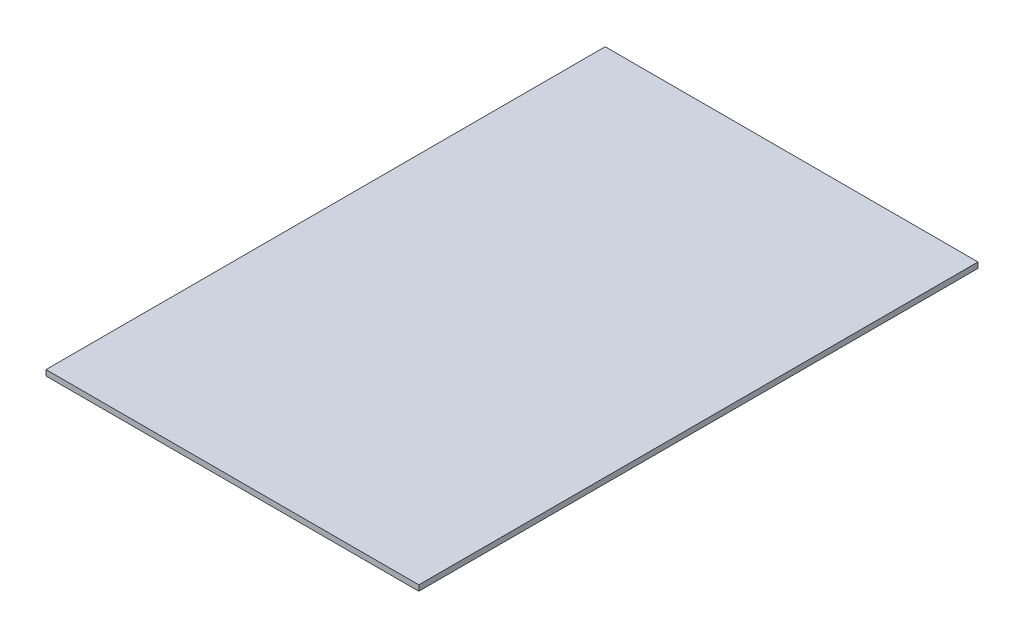
ISO-10303-21;
HEADER;
FILE_DESCRIPTION(('STEP AP214'),'2;1');
FILE_NAME('part.step','',(''),(''),'','','');
FILE_SCHEMA(('AUTOMOTIVE_DESIGN { 1 0 10303 214 1 1 1 1 }'));
ENDSEC;
DATA;
#1=APPLICATION_CONTEXT('core data for automotive mechanical design processes');
#2=APPLICATION_PROTOCOL_DEFINITION('international standard','automotive_design',2000,#1);
#3=PRODUCT_CONTEXT('',#1,'mechanical');
#4=PRODUCT('Part','Part','',(#3));
#5=PRODUCT_RELATED_PRODUCT_CATEGORY('part','',(#4));
#6=PRODUCT_DEFINITION_FORMATION('','',#4);
#7=PRODUCT_DEFINITION_CONTEXT('part definition',#1,'design');
#8=PRODUCT_DEFINITION('design','',#6,#7);
#9=PRODUCT_DEFINITION_SHAPE('','',#8);
#10=(LENGTH_UNIT() NAMED_UNIT(*) SI_UNIT(.MILLI.,.METRE.));
#11=(NAMED_UNIT(*) PLANE_ANGLE_UNIT() SI_UNIT($,.RADIAN.));
#12=(NAMED_UNIT(*) SI_UNIT($,.STERADIAN.) SOLID_ANGLE_UNIT());
#13=UNCERTAINTY_MEASURE_WITH_UNIT(LENGTH_MEASURE(1.E-05),#10,'distance_accuracy_value','');
#14=(GEOMETRIC_REPRESENTATION_CONTEXT(3) GLOBAL_UNCERTAINTY_ASSIGNED_CONTEXT((#13)) GLOBAL_UNIT_ASSIGNED_CONTEXT((#10,
#11,#12)) REPRESENTATION_CONTEXT('',''));
#15=CARTESIAN_POINT('',(0.,0.,0.));
#16=DIRECTION('',(0.,0.,1.));
#17=DIRECTION('',(1.,0.,0.));
#18=AXIS2_PLACEMENT_3D('',#15,#16,#17);
#19=CARTESIAN_POINT('',(-100.,3.,-150.));
#20=DIRECTION('',(1.,0.,0.));
#21=DIRECTION('',(0.,0.,-1.));
#22=AXIS2_PLACEMENT_3D('',#19,#20,#21);
#23=PLANE('',#22);
#24=DIRECTION('',(0.,0.,1.));
#25=VECTOR('',#24,1.);
#26=CARTESIAN_POINT('',(-100.,0.,-150.));
#27=LINE('',#26,#25);
#28=CARTESIAN_POINT('',(-100.,0.,-150.));
#29=VERTEX_POINT('',#28);
#30=CARTESIAN_POINT('',(-100.,0.,150.));
#31=VERTEX_POINT('',#30);
#32=EDGE_CURVE('E107',#29,#31,#27,.T.);
#33=ORIENTED_EDGE('',*,*,#32,.T.);
#34=DIRECTION('',(0.,-1.,0.));
#35=VECTOR('',#34,1.);
#36=CARTESIAN_POINT('',(-100.,3.,150.));
#37=LINE('',#36,#35);
#38=CARTESIAN_POINT('',(-100.,3.,150.));
#39=VERTEX_POINT('',#38);
#40=EDGE_CURVE('E11',#39,#31,#37,.T.);
#41=ORIENTED_EDGE('',*,*,#40,.F.);
#42=DIRECTION('',(0.,0.,1.));
#43=VECTOR('',#42,1.);
#44=CARTESIAN_POINT('',(-100.,3.,-150.));
#45=LINE('',#44,#43);
#46=CARTESIAN_POINT('',(-100.,3.,-150.));
#47=VERTEX_POINT('',#46);
#48=EDGE_CURVE('E91',#47,#39,#45,.T.);
#49=ORIENTED_EDGE('',*,*,#48,.F.);
#50=DIRECTION('',(0.,-1.,0.));
#51=VECTOR('',#50,1.);
#52=CARTESIAN_POINT('',(-100.,3.,-150.));
#53=LINE('',#52,#51);
#54=EDGE_CURVE('E103',#47,#29,#53,.T.);
#55=ORIENTED_EDGE('',*,*,#54,.T.);
#56=EDGE_LOOP('',(#33,#41,#49,#55));
#57=FACE_BOUND('',#56,.T.);
#58=ADVANCED_FACE('F39',(#57),#23,.F.);
#59=CARTESIAN_POINT('',(100.,3.,150.));
#60=DIRECTION('',(0.,0.,-1.));
#61=DIRECTION('',(-1.,0.,0.));
#62=AXIS2_PLACEMENT_3D('',#59,#60,#61);
#63=PLANE('',#62);
#64=DIRECTION('',(1.,0.,0.));
#65=VECTOR('',#64,1.);
#66=CARTESIAN_POINT('',(100.,0.,150.));
#67=LINE('',#66,#65);
#68=CARTESIAN_POINT('',(100.,0.,150.));
#69=VERTEX_POINT('',#68);
#70=EDGE_CURVE('E96',#31,#69,#67,.T.);
#71=ORIENTED_EDGE('',*,*,#70,.T.);
#72=DIRECTION('',(0.,-1.,0.));
#73=VECTOR('',#72,1.);
#74=CARTESIAN_POINT('',(100.,3.,150.));
#75=LINE('',#74,#73);
#76=CARTESIAN_POINT('',(100.,3.,150.));
#77=VERTEX_POINT('',#76);
#78=EDGE_CURVE('E48',#77,#69,#75,.T.);
#79=ORIENTED_EDGE('',*,*,#78,.F.);
#80=DIRECTION('',(1.,0.,0.));
#81=VECTOR('',#80,1.);
#82=CARTESIAN_POINT('',(100.,3.,150.));
#83=LINE('',#82,#81);
#84=EDGE_CURVE('E86',#39,#77,#83,.T.);
#85=ORIENTED_EDGE('',*,*,#84,.F.);
#86=ORIENTED_EDGE('',*,*,#40,.T.);
#87=EDGE_LOOP('',(#71,#79,#85,#86));
#88=FACE_BOUND('',#87,.T.);
#89=ADVANCED_FACE('F95',(#88),#63,.F.);
#90=CARTESIAN_POINT('',(100.,3.,-150.));
#91=DIRECTION('',(-1.,0.,0.));
#92=DIRECTION('',(0.,0.,1.));
#93=AXIS2_PLACEMENT_3D('',#90,#91,#92);
#94=PLANE('',#93);
#95=DIRECTION('',(0.,0.,-1.));
#96=VECTOR('',#95,1.);
#97=CARTESIAN_POINT('',(100.,0.,-150.));
#98=LINE('',#97,#96);
#99=CARTESIAN_POINT('',(100.,0.,-150.));
#100=VERTEX_POINT('',#99);
#101=EDGE_CURVE('E73',#69,#100,#98,.T.);
#102=ORIENTED_EDGE('',*,*,#101,.T.);
#103=DIRECTION('',(0.,-1.,0.));
#104=VECTOR('',#103,1.);
#105=CARTESIAN_POINT('',(100.,3.,-150.));
#106=LINE('',#105,#104);
#107=CARTESIAN_POINT('',(100.,3.,-150.));
#108=VERTEX_POINT('',#107);
#109=EDGE_CURVE('E98',#108,#100,#106,.T.);
#110=ORIENTED_EDGE('',*,*,#109,.F.);
#111=DIRECTION('',(0.,0.,-1.));
#112=VECTOR('',#111,1.);
#113=CARTESIAN_POINT('',(100.,3.,-150.));
#114=LINE('',#113,#112);
#115=EDGE_CURVE('E89',#77,#108,#114,.T.);
#116=ORIENTED_EDGE('',*,*,#115,.F.);
#117=ORIENTED_EDGE('',*,*,#78,.T.);
#118=EDGE_LOOP('',(#102,#110,#116,#117));
#119=FACE_BOUND('',#118,.T.);
#120=ADVANCED_FACE('F99',(#119),#94,.F.);
#121=CARTESIAN_POINT('',(100.,3.,-150.));
#122=DIRECTION('',(0.,0.,1.));
#123=DIRECTION('',(1.,0.,0.));
#124=AXIS2_PLACEMENT_3D('',#121,#122,#123);
#125=PLANE('',#124);
#126=DIRECTION('',(-1.,0.,0.));
#127=VECTOR('',#126,1.);
#128=CARTESIAN_POINT('',(100.,0.,-150.));
#129=LINE('',#128,#127);
#130=EDGE_CURVE('E79',#100,#29,#129,.T.);
#131=ORIENTED_EDGE('',*,*,#130,.T.);
#132=ORIENTED_EDGE('',*,*,#54,.F.);
#133=DIRECTION('',(-1.,0.,0.));
#134=VECTOR('',#133,1.);
#135=CARTESIAN_POINT('',(100.,3.,-150.));
#136=LINE('',#135,#134);
#137=EDGE_CURVE('E56',#108,#47,#136,.T.);
#138=ORIENTED_EDGE('',*,*,#137,.F.);
#139=ORIENTED_EDGE('',*,*,#109,.T.);
#140=EDGE_LOOP('',(#131,#132,#138,#139));
#141=FACE_BOUND('',#140,.T.);
#142=ADVANCED_FACE('F120',(#141),#125,.F.);
#143=CARTESIAN_POINT('',(0.,3.,0.));
#144=DIRECTION('',(0.,-1.,0.));
#145=DIRECTION('',(0.,0.,-1.));
#146=AXIS2_PLACEMENT_3D('',#143,#144,#145);
#147=PLANE('',#146);
#148=ORIENTED_EDGE('',*,*,#48,.T.);
#149=ORIENTED_EDGE('',*,*,#84,.T.);
#150=ORIENTED_EDGE('',*,*,#115,.T.);
#151=ORIENTED_EDGE('',*,*,#137,.T.);
#152=EDGE_LOOP('',(#148,#149,#150,#151));
#153=FACE_BOUND('',#152,.T.);
#154=ADVANCED_FACE('F87',(#153),#147,.F.);
#155=CARTESIAN_POINT('',(0.,0.,0.));
#156=DIRECTION('',(0.,-1.,0.));
#157=DIRECTION('',(0.,0.,-1.));
#158=AXIS2_PLACEMENT_3D('',#155,#156,#157);
#159=PLANE('',#158);
#160=ORIENTED_EDGE('',*,*,#32,.F.);
#161=ORIENTED_EDGE('',*,*,#130,.F.);
#162=ORIENTED_EDGE('',*,*,#101,.F.);
#163=ORIENTED_EDGE('',*,*,#70,.F.);
#164=EDGE_LOOP('',(#160,#161,#162,#163));
#165=FACE_BOUND('',#164,.T.);
#166=ADVANCED_FACE('F123',(#165),#159,.T.);
#167=CLOSED_SHELL('',(#58,#89,#120,#142,#154,#166));
#168=MANIFOLD_SOLID_BREP('B2',#167);
#169=ADVANCED_BREP_SHAPE_REPRESENTATION('',(#18,#168),#14);
#170=SHAPE_DEFINITION_REPRESENTATION(#9,#169);
ENDSEC;
END-ISO-10303-21;
